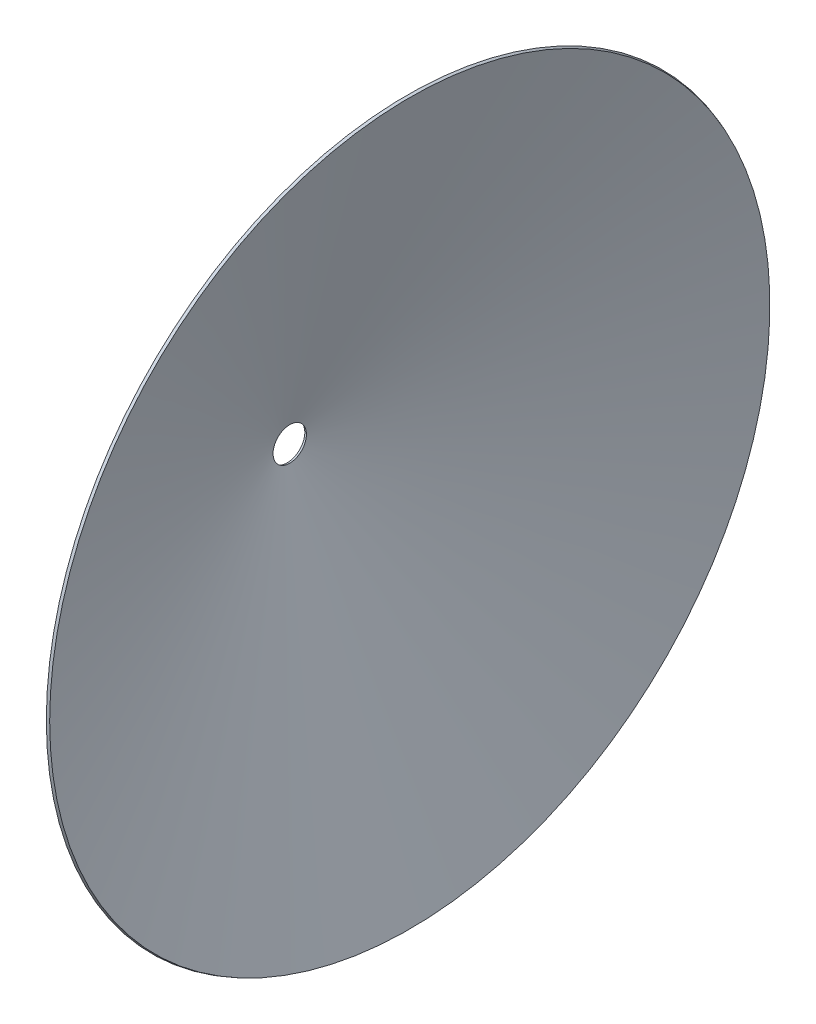
ISO-10303-21;
HEADER;
FILE_DESCRIPTION(('STEP AP214'),'2;1');
FILE_NAME('part.step','',(''),(''),'','','');
FILE_SCHEMA(('AUTOMOTIVE_DESIGN { 1 0 10303 214 1 1 1 1 }'));
ENDSEC;
DATA;
#1=APPLICATION_CONTEXT('core data for automotive mechanical design processes');
#2=APPLICATION_PROTOCOL_DEFINITION('international standard','automotive_design',2000,#1);
#3=PRODUCT_CONTEXT('',#1,'mechanical');
#4=PRODUCT('Part','Part','',(#3));
#5=PRODUCT_RELATED_PRODUCT_CATEGORY('part','',(#4));
#6=PRODUCT_DEFINITION_FORMATION('','',#4);
#7=PRODUCT_DEFINITION_CONTEXT('part definition',#1,'design');
#8=PRODUCT_DEFINITION('design','',#6,#7);
#9=PRODUCT_DEFINITION_SHAPE('','',#8);
#10=(LENGTH_UNIT() NAMED_UNIT(*) SI_UNIT(.MILLI.,.METRE.));
#11=(NAMED_UNIT(*) PLANE_ANGLE_UNIT() SI_UNIT($,.RADIAN.));
#12=(NAMED_UNIT(*) SI_UNIT($,.STERADIAN.) SOLID_ANGLE_UNIT());
#13=UNCERTAINTY_MEASURE_WITH_UNIT(LENGTH_MEASURE(1.E-05),#10,'distance_accuracy_value','');
#14=(GEOMETRIC_REPRESENTATION_CONTEXT(3) GLOBAL_UNCERTAINTY_ASSIGNED_CONTEXT((#13)) GLOBAL_UNIT_ASSIGNED_CONTEXT((#10,
#11,#12)) REPRESENTATION_CONTEXT('',''));
#15=CARTESIAN_POINT('',(0.,0.,0.));
#16=DIRECTION('',(0.,0.,1.));
#17=DIRECTION('',(1.,0.,0.));
#18=AXIS2_PLACEMENT_3D('',#15,#16,#17);
#19=CARTESIAN_POINT('',(-9.44001153196571,0.,-312.416154258248));
#20=DIRECTION('',(1.,0.,0.));
#21=DIRECTION('',(0.,0.,-1.));
#22=AXIS2_PLACEMENT_3D('',#19,#20,#21);
#23=CONICAL_SURFACE('',#22,66.7994215063181,1.23455403333275);
#24=CARTESIAN_POINT('',(447.759988468034,0.,-312.416154258248));
#25=DIRECTION('',(-1.,0.,0.));
#26=DIRECTION('',(0.,0.,1.));
#27=AXIS2_PLACEMENT_3D('',#24,#25,#26);
#28=CIRCLE('',#27,1374.89942150632);
#29=CARTESIAN_POINT('',(447.759988468034,0.,1062.48326724807));
#30=VERTEX_POINT('',#29);
#31=EDGE_CURVE('E45',#30,#30,#28,.T.);
#32=ORIENTED_EDGE('',*,*,#31,.T.);
#33=EDGE_LOOP('',(#32));
#34=FACE_BOUND('',#33,.T.);
#35=CARTESIAN_POINT('',(-9.44001153196571,0.,-312.416154258248));
#36=DIRECTION('',(-1.,0.,0.));
#37=DIRECTION('',(0.,0.,1.));
#38=AXIS2_PLACEMENT_3D('',#35,#36,#37);
#39=CIRCLE('',#38,66.7994215063181);
#40=CARTESIAN_POINT('',(-9.44001153196571,0.,-245.61673275193));
#41=VERTEX_POINT('',#40);
#42=EDGE_CURVE('E10',#41,#41,#39,.T.);
#43=ORIENTED_EDGE('',*,*,#42,.F.);
#44=EDGE_LOOP('',(#43));
#45=FACE_BOUND('',#44,.T.);
#46=ADVANCED_FACE('F31',(#34,#45),#23,.T.);
#47=CARTESIAN_POINT('',(-9.44001153196571,0.,-312.416154258248));
#48=DIRECTION('',(-1.,0.,0.));
#49=DIRECTION('',(0.,0.,1.));
#50=AXIS2_PLACEMENT_3D('',#47,#48,#49);
#51=CONICAL_SURFACE('',#50,66.7994215063181,0.336242293462143);
#52=CARTESIAN_POINT('',(0.,0.,-312.416154258248));
#53=DIRECTION('',(-1.,0.,0.));
#54=DIRECTION('',(0.,0.,1.));
#55=AXIS2_PLACEMENT_3D('',#52,#53,#54);
#56=CIRCLE('',#55,63.5);
#57=CARTESIAN_POINT('',(0.,0.,-248.916154258248));
#58=VERTEX_POINT('',#57);
#59=EDGE_CURVE('E37',#58,#58,#56,.T.);
#60=ORIENTED_EDGE('',*,*,#59,.F.);
#61=EDGE_LOOP('',(#60));
#62=FACE_BOUND('',#61,.T.);
#63=ORIENTED_EDGE('',*,*,#42,.T.);
#64=EDGE_LOOP('',(#63));
#65=FACE_BOUND('',#64,.T.);
#66=ADVANCED_FACE('F61',(#62,#65),#51,.F.);
#67=CARTESIAN_POINT('',(0.,0.,-312.416154258248));
#68=DIRECTION('',(1.,0.,0.));
#69=DIRECTION('',(0.,0.,-1.));
#70=AXIS2_PLACEMENT_3D('',#67,#68,#69);
#71=CONICAL_SURFACE('',#70,63.5,1.23455403333275);
#72=CARTESIAN_POINT('',(457.2,0.,-312.416154258248));
#73=DIRECTION('',(-1.,0.,0.));
#74=DIRECTION('',(0.,0.,1.));
#75=AXIS2_PLACEMENT_3D('',#72,#73,#74);
#76=CIRCLE('',#75,1371.6);
#77=CARTESIAN_POINT('',(457.2,0.,1059.18384574175));
#78=VERTEX_POINT('',#77);
#79=EDGE_CURVE('E41',#78,#78,#76,.T.);
#80=ORIENTED_EDGE('',*,*,#79,.F.);
#81=EDGE_LOOP('',(#80));
#82=FACE_BOUND('',#81,.T.);
#83=ORIENTED_EDGE('',*,*,#59,.T.);
#84=EDGE_LOOP('',(#83));
#85=FACE_BOUND('',#84,.T.);
#86=ADVANCED_FACE('F56',(#82,#85),#71,.F.);
#87=CARTESIAN_POINT('',(457.2,0.,-312.416154258248));
#88=DIRECTION('',(-1.,0.,0.));
#89=DIRECTION('',(0.,0.,1.));
#90=AXIS2_PLACEMENT_3D('',#87,#88,#89);
#91=CONICAL_SURFACE('',#90,1371.6,0.336242293462134);
#92=ORIENTED_EDGE('',*,*,#31,.F.);
#93=EDGE_LOOP('',(#92));
#94=FACE_BOUND('',#93,.T.);
#95=ORIENTED_EDGE('',*,*,#79,.T.);
#96=EDGE_LOOP('',(#95));
#97=FACE_BOUND('',#96,.T.);
#98=ADVANCED_FACE('F53',(#94,#97),#91,.T.);
#99=CLOSED_SHELL('',(#46,#66,#86,#98));
#100=MANIFOLD_SOLID_BREP('B2',#99);
#101=ADVANCED_BREP_SHAPE_REPRESENTATION('',(#18,#100),#14);
#102=SHAPE_DEFINITION_REPRESENTATION(#9,#101);
ENDSEC;
END-ISO-10303-21;
